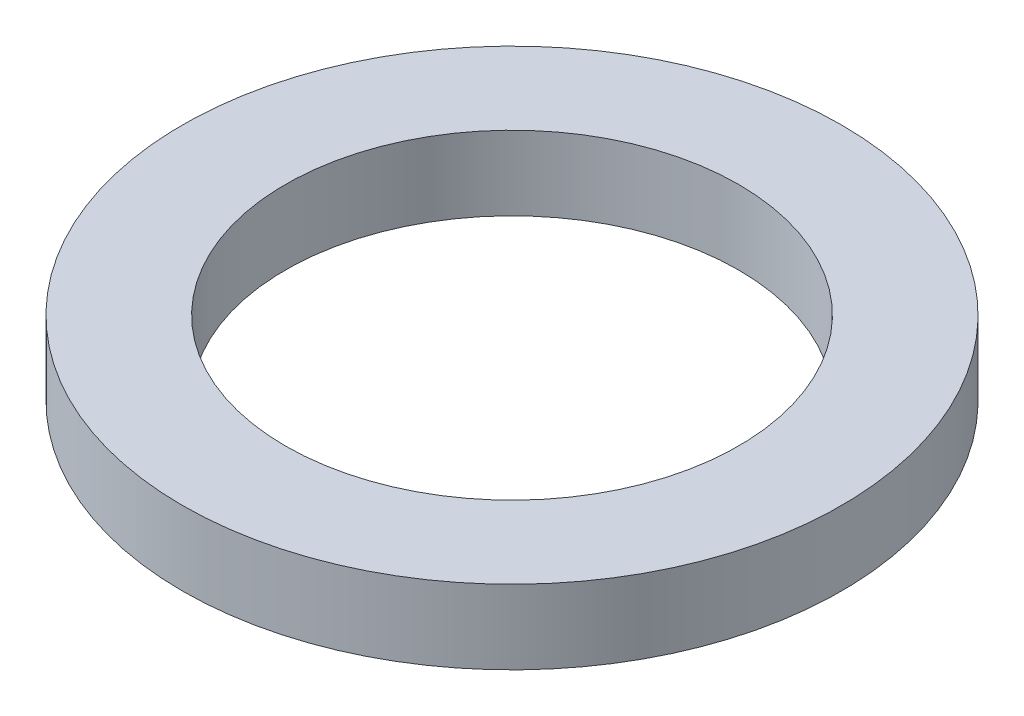
ISO-10303-21;
HEADER;
FILE_DESCRIPTION(('STEP AP214'),'2;1');
FILE_NAME('part.step','',(''),(''),'','','');
FILE_SCHEMA(('AUTOMOTIVE_DESIGN { 1 0 10303 214 1 1 1 1 }'));
ENDSEC;
DATA;
#1=APPLICATION_CONTEXT('core data for automotive mechanical design processes');
#2=APPLICATION_PROTOCOL_DEFINITION('international standard','automotive_design',2000,#1);
#3=PRODUCT_CONTEXT('',#1,'mechanical');
#4=PRODUCT('Part','Part','',(#3));
#5=PRODUCT_RELATED_PRODUCT_CATEGORY('part','',(#4));
#6=PRODUCT_DEFINITION_FORMATION('','',#4);
#7=PRODUCT_DEFINITION_CONTEXT('part definition',#1,'design');
#8=PRODUCT_DEFINITION('design','',#6,#7);
#9=PRODUCT_DEFINITION_SHAPE('','',#8);
#10=(LENGTH_UNIT() NAMED_UNIT(*) SI_UNIT(.MILLI.,.METRE.));
#11=(NAMED_UNIT(*) PLANE_ANGLE_UNIT() SI_UNIT($,.RADIAN.));
#12=(NAMED_UNIT(*) SI_UNIT($,.STERADIAN.) SOLID_ANGLE_UNIT());
#13=UNCERTAINTY_MEASURE_WITH_UNIT(LENGTH_MEASURE(1.E-05),#10,'distance_accuracy_value','');
#14=(GEOMETRIC_REPRESENTATION_CONTEXT(3) GLOBAL_UNCERTAINTY_ASSIGNED_CONTEXT((#13)) GLOBAL_UNIT_ASSIGNED_CONTEXT((#10,
#11,#12)) REPRESENTATION_CONTEXT('',''));
#15=CARTESIAN_POINT('',(0.,0.,0.));
#16=DIRECTION('',(0.,0.,1.));
#17=DIRECTION('',(1.,0.,0.));
#18=AXIS2_PLACEMENT_3D('',#15,#16,#17);
#19=CARTESIAN_POINT('',(0.,9.,0.));
#20=DIRECTION('',(0.,-1.,0.));
#21=DIRECTION('',(0.,0.,-1.));
#22=AXIS2_PLACEMENT_3D('',#19,#20,#21);
#23=CYLINDRICAL_SURFACE('',#22,40.);
#24=CARTESIAN_POINT('',(0.,9.,0.));
#25=DIRECTION('',(0.,1.,0.));
#26=DIRECTION('',(0.,0.,1.));
#27=AXIS2_PLACEMENT_3D('',#24,#25,#26);
#28=CIRCLE('',#27,40.);
#29=CARTESIAN_POINT('',(0.,9.,40.));
#30=VERTEX_POINT('',#29);
#31=EDGE_CURVE('E10',#30,#30,#28,.T.);
#32=ORIENTED_EDGE('',*,*,#31,.F.);
#33=EDGE_LOOP('',(#32));
#34=FACE_BOUND('',#33,.T.);
#35=CARTESIAN_POINT('',(0.,0.,0.));
#36=DIRECTION('',(0.,1.,0.));
#37=DIRECTION('',(0.,0.,1.));
#38=AXIS2_PLACEMENT_3D('',#35,#36,#37);
#39=CIRCLE('',#38,40.);
#40=CARTESIAN_POINT('',(0.,0.,40.));
#41=VERTEX_POINT('',#40);
#42=EDGE_CURVE('E37',#41,#41,#39,.T.);
#43=ORIENTED_EDGE('',*,*,#42,.T.);
#44=EDGE_LOOP('',(#43));
#45=FACE_BOUND('',#44,.T.);
#46=ADVANCED_FACE('F40',(#34,#45),#23,.T.);
#47=CARTESIAN_POINT('',(0.,9.,0.));
#48=DIRECTION('',(0.,1.,0.));
#49=DIRECTION('',(0.,0.,1.));
#50=AXIS2_PLACEMENT_3D('',#47,#48,#49);
#51=PLANE('',#50);
#52=CARTESIAN_POINT('',(0.,9.,0.));
#53=DIRECTION('',(0.,1.,0.));
#54=DIRECTION('',(0.,0.,1.));
#55=AXIS2_PLACEMENT_3D('',#52,#53,#54);
#56=CIRCLE('',#55,27.5);
#57=CARTESIAN_POINT('',(0.,9.,27.5));
#58=VERTEX_POINT('',#57);
#59=EDGE_CURVE('E50',#58,#58,#56,.T.);
#60=ORIENTED_EDGE('',*,*,#59,.F.);
#61=EDGE_LOOP('',(#60));
#62=FACE_BOUND('',#61,.T.);
#63=ORIENTED_EDGE('',*,*,#31,.T.);
#64=EDGE_LOOP('',(#63));
#65=FACE_BOUND('',#64,.T.);
#66=ADVANCED_FACE('F59',(#62,#65),#51,.T.);
#67=CARTESIAN_POINT('',(0.,0.,0.));
#68=DIRECTION('',(0.,1.,0.));
#69=DIRECTION('',(0.,0.,1.));
#70=AXIS2_PLACEMENT_3D('',#67,#68,#69);
#71=PLANE('',#70);
#72=CARTESIAN_POINT('',(0.,0.,0.));
#73=DIRECTION('',(0.,1.,0.));
#74=DIRECTION('',(0.,0.,1.));
#75=AXIS2_PLACEMENT_3D('',#72,#73,#74);
#76=CIRCLE('',#75,27.5);
#77=CARTESIAN_POINT('',(0.,0.,27.5));
#78=VERTEX_POINT('',#77);
#79=EDGE_CURVE('E47',#78,#78,#76,.T.);
#80=ORIENTED_EDGE('',*,*,#79,.T.);
#81=EDGE_LOOP('',(#80));
#82=FACE_BOUND('',#81,.T.);
#83=ORIENTED_EDGE('',*,*,#42,.F.);
#84=EDGE_LOOP('',(#83));
#85=FACE_BOUND('',#84,.T.);
#86=ADVANCED_FACE('F58',(#82,#85),#71,.F.);
#87=CARTESIAN_POINT('',(0.,9.,0.));
#88=DIRECTION('',(0.,-1.,0.));
#89=DIRECTION('',(0.,0.,-1.));
#90=AXIS2_PLACEMENT_3D('',#87,#88,#89);
#91=CYLINDRICAL_SURFACE('',#90,27.5);
#92=ORIENTED_EDGE('',*,*,#59,.T.);
#93=EDGE_LOOP('',(#92));
#94=FACE_BOUND('',#93,.T.);
#95=ORIENTED_EDGE('',*,*,#79,.F.);
#96=EDGE_LOOP('',(#95));
#97=FACE_BOUND('',#96,.T.);
#98=ADVANCED_FACE('F54',(#94,#97),#91,.F.);
#99=CLOSED_SHELL('',(#46,#66,#86,#98));
#100=MANIFOLD_SOLID_BREP('B2',#99);
#101=ADVANCED_BREP_SHAPE_REPRESENTATION('',(#18,#100),#14);
#102=SHAPE_DEFINITION_REPRESENTATION(#9,#101);
ENDSEC;
END-ISO-10303-21;
